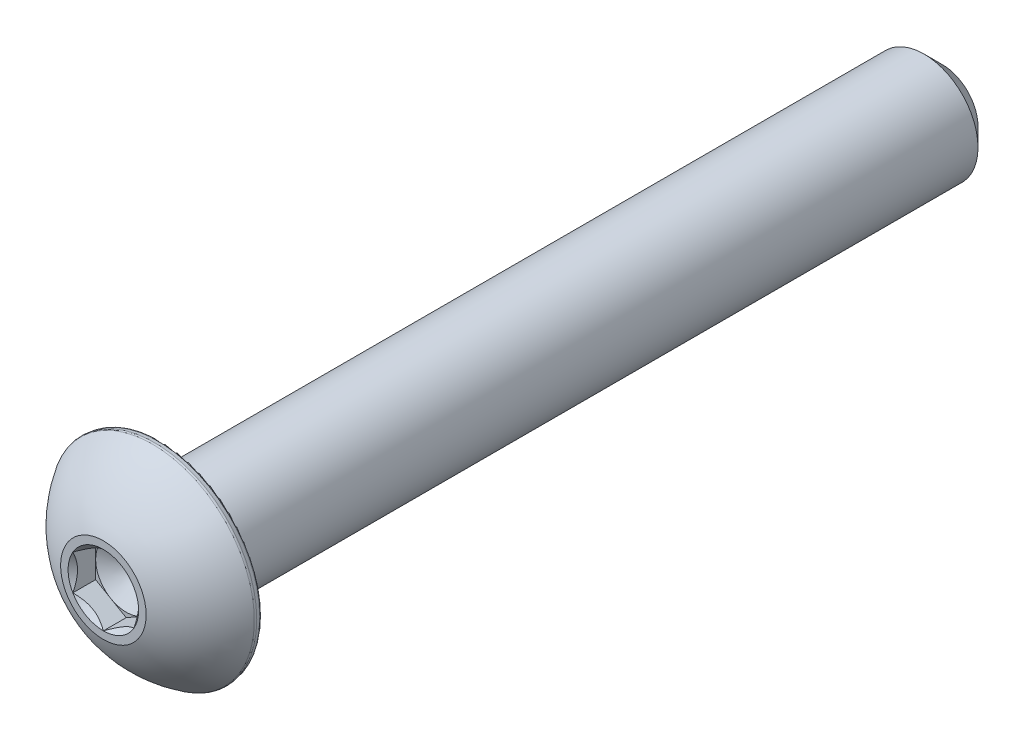
ISO-10303-21;
HEADER;
FILE_DESCRIPTION(('STEP AP214'),'2;1');
FILE_NAME('part.step','',(''),(''),'','','');
FILE_SCHEMA(('AUTOMOTIVE_DESIGN { 1 0 10303 214 1 1 1 1 }'));
ENDSEC;
DATA;
#1=APPLICATION_CONTEXT('core data for automotive mechanical design processes');
#2=APPLICATION_PROTOCOL_DEFINITION('international standard','automotive_design',2000,#1);
#3=PRODUCT_CONTEXT('',#1,'mechanical');
#4=PRODUCT('Part','Part','',(#3));
#5=PRODUCT_RELATED_PRODUCT_CATEGORY('part','',(#4));
#6=PRODUCT_DEFINITION_FORMATION('','',#4);
#7=PRODUCT_DEFINITION_CONTEXT('part definition',#1,'design');
#8=PRODUCT_DEFINITION('design','',#6,#7);
#9=PRODUCT_DEFINITION_SHAPE('','',#8);
#10=(LENGTH_UNIT() NAMED_UNIT(*) SI_UNIT(.MILLI.,.METRE.));
#11=(NAMED_UNIT(*) PLANE_ANGLE_UNIT() SI_UNIT($,.RADIAN.));
#12=(NAMED_UNIT(*) SI_UNIT($,.STERADIAN.) SOLID_ANGLE_UNIT());
#13=UNCERTAINTY_MEASURE_WITH_UNIT(LENGTH_MEASURE(1.E-05),#10,'distance_accuracy_value','');
#14=(GEOMETRIC_REPRESENTATION_CONTEXT(3) GLOBAL_UNCERTAINTY_ASSIGNED_CONTEXT((#13)) GLOBAL_UNIT_ASSIGNED_CONTEXT((#10,
#11,#12)) REPRESENTATION_CONTEXT('',''));
#15=CARTESIAN_POINT('',(0.,0.,0.));
#16=DIRECTION('',(0.,0.,1.));
#17=DIRECTION('',(1.,0.,0.));
#18=AXIS2_PLACEMENT_3D('',#15,#16,#17);
#19=CARTESIAN_POINT('',(0.,0.9921875,13.6271));
#20=DIRECTION('',(0.,0.,-1.));
#21=DIRECTION('',(-1.,0.,0.));
#22=AXIS2_PLACEMENT_3D('',#19,#20,#21);
#23=PLANE('',#22);
#24=CARTESIAN_POINT('',(0.,0.,13.6271));
#25=DIRECTION('',(0.,0.,1.));
#26=DIRECTION('',(1.,0.,0.));
#27=AXIS2_PLACEMENT_3D('',#24,#25,#26);
#28=CIRCLE('',#27,1.3890625);
#29=CARTESIAN_POINT('',(1.3890625,0.,13.6271));
#30=VERTEX_POINT('',#29);
#31=EDGE_CURVE('E175',#30,#30,#28,.T.);
#32=ORIENTED_EDGE('',*,*,#31,.T.);
#33=EDGE_LOOP('',(#32));
#34=FACE_BOUND('',#33,.T.);
#35=CARTESIAN_POINT('',(0.,0.,13.6271));
#36=DIRECTION('',(0.,0.,1.));
#37=DIRECTION('',(1.,0.,0.));
#38=AXIS2_PLACEMENT_3D('',#35,#36,#37);
#39=CIRCLE('',#38,1.14567944042316);
#40=CARTESIAN_POINT('',(0.,1.14567944042316,13.6271));
#41=VERTEX_POINT('',#40);
#42=CARTESIAN_POINT('',(-0.992187500000001,0.57283972021158,13.6271));
#43=VERTEX_POINT('',#42);
#44=EDGE_CURVE('E129',#41,#43,#39,.T.);
#45=ORIENTED_EDGE('',*,*,#44,.F.);
#46=CARTESIAN_POINT('',(0.,0.,13.6271));
#47=DIRECTION('',(0.,0.,1.));
#48=DIRECTION('',(1.,0.,0.));
#49=AXIS2_PLACEMENT_3D('',#46,#47,#48);
#50=CIRCLE('',#49,1.14567944042316);
#51=CARTESIAN_POINT('',(0.9921875,0.572839720211582,13.6271));
#52=VERTEX_POINT('',#51);
#53=EDGE_CURVE('E114',#52,#41,#50,.T.);
#54=ORIENTED_EDGE('',*,*,#53,.F.);
#55=CARTESIAN_POINT('',(0.,0.,13.6271));
#56=DIRECTION('',(0.,0.,1.));
#57=DIRECTION('',(1.,0.,0.));
#58=AXIS2_PLACEMENT_3D('',#55,#56,#57);
#59=CIRCLE('',#58,1.14567944042316);
#60=CARTESIAN_POINT('',(0.9921875,-0.572839720211582,13.6271));
#61=VERTEX_POINT('',#60);
#62=EDGE_CURVE('E125',#61,#52,#59,.T.);
#63=ORIENTED_EDGE('',*,*,#62,.F.);
#64=CARTESIAN_POINT('',(0.,0.,13.6271));
#65=DIRECTION('',(0.,0.,1.));
#66=DIRECTION('',(1.,0.,0.));
#67=AXIS2_PLACEMENT_3D('',#64,#65,#66);
#68=CIRCLE('',#67,1.14567944042316);
#69=CARTESIAN_POINT('',(0.,-1.14567944042316,13.6271));
#70=VERTEX_POINT('',#69);
#71=EDGE_CURVE('E146',#70,#61,#68,.T.);
#72=ORIENTED_EDGE('',*,*,#71,.F.);
#73=CARTESIAN_POINT('',(0.,0.,13.6271));
#74=DIRECTION('',(0.,0.,1.));
#75=DIRECTION('',(1.,0.,0.));
#76=AXIS2_PLACEMENT_3D('',#73,#74,#75);
#77=CIRCLE('',#76,1.14567944042316);
#78=CARTESIAN_POINT('',(-0.9921875,-0.572839720211582,13.6271));
#79=VERTEX_POINT('',#78);
#80=EDGE_CURVE('E548',#79,#70,#77,.T.);
#81=ORIENTED_EDGE('',*,*,#80,.F.);
#82=CARTESIAN_POINT('',(0.,0.,13.6271));
#83=DIRECTION('',(0.,0.,1.));
#84=DIRECTION('',(1.,0.,0.));
#85=AXIS2_PLACEMENT_3D('',#82,#83,#84);
#86=CIRCLE('',#85,1.14567944042316);
#87=EDGE_CURVE('E292',#43,#79,#86,.T.);
#88=ORIENTED_EDGE('',*,*,#87,.F.);
#89=EDGE_LOOP('',(#45,#54,#63,#72,#81,#88));
#90=FACE_BOUND('',#89,.T.);
#91=ADVANCED_FACE('F41',(#34,#90),#23,.F.);
#92=CARTESIAN_POINT('',(0.,0.,-13.6271));
#93=DIRECTION('',(0.,0.,1.));
#94=DIRECTION('',(1.,0.,0.));
#95=AXIS2_PLACEMENT_3D('',#92,#93,#94);
#96=CONICAL_SURFACE('',#95,1.1572875,0.785398163397447);
#97=CARTESIAN_POINT('',(0.,0.,-13.0317875));
#98=DIRECTION('',(0.,0.,1.));
#99=DIRECTION('',(1.,0.,0.));
#100=AXIS2_PLACEMENT_3D('',#97,#98,#99);
#101=CIRCLE('',#100,1.7526);
#102=CARTESIAN_POINT('',(1.7526,0.,-13.0317875));
#103=VERTEX_POINT('',#102);
#104=EDGE_CURVE('E182',#103,#103,#101,.T.);
#105=ORIENTED_EDGE('',*,*,#104,.F.);
#106=EDGE_LOOP('',(#105));
#107=FACE_BOUND('',#106,.T.);
#108=CARTESIAN_POINT('',(0.,0.,-13.6271));
#109=DIRECTION('',(0.,0.,1.));
#110=DIRECTION('',(1.,0.,0.));
#111=AXIS2_PLACEMENT_3D('',#108,#109,#110);
#112=CIRCLE('',#111,1.1572875);
#113=CARTESIAN_POINT('',(1.1572875,0.,-13.6271));
#114=VERTEX_POINT('',#113);
#115=EDGE_CURVE('E168',#114,#114,#112,.T.);
#116=ORIENTED_EDGE('',*,*,#115,.T.);
#117=EDGE_LOOP('',(#116));
#118=FACE_BOUND('',#117,.T.);
#119=ADVANCED_FACE('F219',(#107,#118),#96,.T.);
#120=CARTESIAN_POINT('',(0.,0.,13.6271));
#121=DIRECTION('',(0.,0.,1.));
#122=DIRECTION('',(1.,0.,0.));
#123=AXIS2_PLACEMENT_3D('',#120,#121,#122);
#124=CYLINDRICAL_SURFACE('',#123,1.7526);
#125=CARTESIAN_POINT('',(0.,0.,11.7729));
#126=DIRECTION('',(0.,0.,1.));
#127=DIRECTION('',(1.,0.,0.));
#128=AXIS2_PLACEMENT_3D('',#125,#126,#127);
#129=CIRCLE('',#128,1.7526);
#130=CARTESIAN_POINT('',(1.7526,0.,11.7729));
#131=VERTEX_POINT('',#130);
#132=EDGE_CURVE('E179',#131,#131,#129,.T.);
#133=ORIENTED_EDGE('',*,*,#132,.F.);
#134=EDGE_LOOP('',(#133));
#135=FACE_BOUND('',#134,.T.);
#136=ORIENTED_EDGE('',*,*,#104,.T.);
#137=EDGE_LOOP('',(#136));
#138=FACE_BOUND('',#137,.T.);
#139=ADVANCED_FACE('F226',(#135,#138),#124,.T.);
#140=CARTESIAN_POINT('',(0.,3.28741155973219,11.7729));
#141=DIRECTION('',(0.,0.,1.));
#142=DIRECTION('',(1.,0.,0.));
#143=AXIS2_PLACEMENT_3D('',#140,#141,#142);
#144=PLANE('',#143);
#145=CARTESIAN_POINT('',(0.,0.,11.7729));
#146=DIRECTION('',(0.,0.,1.));
#147=DIRECTION('',(1.,0.,0.));
#148=AXIS2_PLACEMENT_3D('',#145,#146,#147);
#149=CIRCLE('',#148,3.20961863292574);
#150=CARTESIAN_POINT('',(3.20961863292574,0.,11.7729));
#151=VERTEX_POINT('',#150);
#152=EDGE_CURVE('E49',#151,#151,#149,.F.);
#153=ORIENTED_EDGE('',*,*,#152,.T.);
#154=EDGE_LOOP('',(#153));
#155=FACE_BOUND('',#154,.T.);
#156=ORIENTED_EDGE('',*,*,#132,.T.);
#157=EDGE_LOOP('',(#156));
#158=FACE_BOUND('',#157,.T.);
#159=ADVANCED_FACE('F193',(#155,#158),#144,.F.);
#160=CARTESIAN_POINT('',(0.,0.,11.7729));
#161=DIRECTION('',(0.,0.,1.));
#162=DIRECTION('',(1.,0.,0.));
#163=AXIS2_PLACEMENT_3D('',#160,#161,#162);
#164=CONICAL_SURFACE('',#163,3.28741155973219,0.174532925199426);
#165=CARTESIAN_POINT('',(0.,0.,11.8495110774485));
#166=DIRECTION('',(0.,0.,-1.));
#167=DIRECTION('',(-1.,0.,0.));
#168=AXIS2_PLACEMENT_3D('',#165,#166,#167);
#169=CIRCLE('',#168,3.30092015970751);
#170=CARTESIAN_POINT('',(-3.30092015970751,0.,11.8495110774485));
#171=VERTEX_POINT('',#170);
#172=EDGE_CURVE('E188',#171,#171,#169,.F.);
#173=ORIENTED_EDGE('',*,*,#172,.T.);
#174=EDGE_LOOP('',(#173));
#175=FACE_BOUND('',#174,.T.);
#176=CARTESIAN_POINT('',(0.,0.,11.965362863037));
#177=DIRECTION('',(0.,0.,-1.));
#178=DIRECTION('',(-1.,0.,0.));
#179=AXIS2_PLACEMENT_3D('',#176,#177,#178);
#180=CIRCLE('',#179,3.32134795527);
#181=CARTESIAN_POINT('',(-3.32134795527,0.,11.965362863037));
#182=VERTEX_POINT('',#181);
#183=EDGE_CURVE('E185',#182,#182,#180,.T.);
#184=ORIENTED_EDGE('',*,*,#183,.T.);
#185=EDGE_LOOP('',(#184));
#186=FACE_BOUND('',#185,.T.);
#187=ADVANCED_FACE('F201',(#175,#186),#164,.T.);
#188=CARTESIAN_POINT('',(0.,0.,10.0046132454163));
#189=DIRECTION('',(0.,0.,1.));
#190=DIRECTION('',(0.,1.,0.));
#191=AXIS2_PLACEMENT_3D('',#188,#189,#190);
#192=SPHERICAL_SURFACE('',#191,3.87967845523838);
#193=CARTESIAN_POINT('',(0.,0.,12.029857654296));
#194=DIRECTION('',(0.,0.,-1.));
#195=DIRECTION('',(-1.,0.,0.));
#196=AXIS2_PLACEMENT_3D('',#193,#194,#195);
#197=CIRCLE('',#196,3.30912224016312);
#198=CARTESIAN_POINT('',(-3.30912224016312,0.,12.029857654296));
#199=VERTEX_POINT('',#198);
#200=EDGE_CURVE('E11',#199,#199,#197,.F.);
#201=ORIENTED_EDGE('',*,*,#200,.T.);
#202=EDGE_LOOP('',(#201));
#203=FACE_BOUND('',#202,.T.);
#204=ORIENTED_EDGE('',*,*,#31,.F.);
#205=EDGE_LOOP('',(#204));
#206=FACE_BOUND('',#205,.T.);
#207=ADVANCED_FACE('F204',(#203,#206),#192,.T.);
#208=CARTESIAN_POINT('',(0.,1.1572875,-13.6271));
#209=DIRECTION('',(0.,0.,1.));
#210=DIRECTION('',(1.,0.,0.));
#211=AXIS2_PLACEMENT_3D('',#208,#209,#210);
#212=PLANE('',#211);
#213=ORIENTED_EDGE('',*,*,#115,.F.);
#214=EDGE_LOOP('',(#213));
#215=FACE_BOUND('',#214,.T.);
#216=ADVANCED_FACE('F214',(#215),#212,.F.);
#217=CARTESIAN_POINT('',(0.9921875,0.572839720211583,13.6271));
#218=DIRECTION('',(-0.5,-0.866025403784439,0.));
#219=DIRECTION('',(0.866025403784439,-0.5,0.));
#220=AXIS2_PLACEMENT_3D('',#217,#218,#219);
#221=PLANE('',#220);
#222=CARTESIAN_POINT('',(0.9923875,0.572724250157745,13.627215487509));
#223=CARTESIAN_POINT('',(0.958273424767844,0.592420020676185,13.6075328114047));
#224=CARTESIAN_POINT('',(0.923588910507721,0.612445134320979,13.5890056845184));
#225=CARTESIAN_POINT('',(0.852862918800041,0.65327880467211,13.5550823296504));
#226=CARTESIAN_POINT('',(0.816814708375758,0.674091248664374,13.5397049872309));
#227=CARTESIAN_POINT('',(0.744124988262605,0.716058678139022,13.5133631427343));
#228=CARTESIAN_POINT('',(0.707502010986799,0.737202963927734,13.5023323965131));
#229=CARTESIAN_POINT('',(0.633449993753944,0.779956916011157,13.4853362056729));
#230=CARTESIAN_POINT('',(0.596023217440658,0.801565275390533,13.4793580675789));
#231=CARTESIAN_POINT('',(0.53152286139453,0.838804573316592,13.4739663449143));
#232=CARTESIAN_POINT('',(0.504533200685471,0.854387061192303,13.4731689963883));
#233=CARTESIAN_POINT('',(0.450606144054337,0.885521861854893,13.4745081933614));
#234=CARTESIAN_POINT('',(0.423668760975761,0.901074167226573,13.476645386137));
#235=CARTESIAN_POINT('',(0.343241277041503,0.947508996726261,13.487317571306));
#236=CARTESIAN_POINT('',(0.290151430636718,0.9781604338393,13.5001143807227));
#237=CARTESIAN_POINT('',(0.196972862034203,1.03195710550467,13.5309974676501));
#238=CARTESIAN_POINT('',(0.156447193690484,1.055354611032,13.5474650089077));
#239=CARTESIAN_POINT('',(0.0769831842917925,1.10123317824922,13.5845603835568));
#240=CARTESIAN_POINT('',(0.0380401617384759,1.12371694280344,13.6051746806455));
#241=CARTESIAN_POINT('',(-0.000200000000000987,1.145794910477,13.627215487509));
#242=B_SPLINE_CURVE_WITH_KNOTS('',3,(#222,#223,#224,#225,#226,#227,#228,#229,#230,#231,#232,
#233,#234,#235,#236,#237,#238,#239,#240,#241),.UNSPECIFIED.,.F.,.F.,(4,2,2,2,2,2,2,2,2,4),(0.,
0.13219718521019,0.265165186853262,0.396020097605669,0.526545281028573,0.619935205043264,
0.713345731536163,0.900220051846368,1.04884529769095,1.1969930355767),.UNSPECIFIED.);
#243=EDGE_CURVE('E111',#52,#41,#242,.T.);
#244=ORIENTED_EDGE('',*,*,#243,.T.);
#245=DIRECTION('',(0.,0.,-1.));
#246=VECTOR('',#245,1.);
#247=CARTESIAN_POINT('',(0.,1.14567944042316,13.6271));
#248=LINE('',#247,#246);
#249=CARTESIAN_POINT('',(0.,1.14567944042316,12.88542));
#250=VERTEX_POINT('',#249);
#251=EDGE_CURVE('E166',#41,#250,#248,.T.);
#252=ORIENTED_EDGE('',*,*,#251,.T.);
#253=DIRECTION('',(-0.866025403784439,0.5,0.));
#254=VECTOR('',#253,1.);
#255=CARTESIAN_POINT('',(0.9921875,0.572839720211583,12.88542));
#256=LINE('',#255,#254);
#257=CARTESIAN_POINT('',(0.496093749999999,0.859259580317373,12.88542));
#258=VERTEX_POINT('',#257);
#259=EDGE_CURVE('E295',#258,#250,#256,.T.);
#260=ORIENTED_EDGE('',*,*,#259,.F.);
#261=CARTESIAN_POINT('',(0.9921875,0.572839720211583,12.88542));
#262=VERTEX_POINT('',#261);
#263=EDGE_CURVE('E56',#262,#258,#256,.T.);
#264=ORIENTED_EDGE('',*,*,#263,.F.);
#265=DIRECTION('',(0.,0.,-1.));
#266=VECTOR('',#265,1.);
#267=CARTESIAN_POINT('',(0.9921875,0.572839720211583,13.6271));
#268=LINE('',#267,#266);
#269=EDGE_CURVE('E142',#52,#262,#268,.T.);
#270=ORIENTED_EDGE('',*,*,#269,.F.);
#271=EDGE_LOOP('',(#244,#252,#260,#264,#270));
#272=FACE_BOUND('',#271,.T.);
#273=ADVANCED_FACE('F148',(#272),#221,.T.);
#274=CARTESIAN_POINT('',(0.,1.14567944042316,13.6271));
#275=DIRECTION('',(0.500000000000001,-0.866025403784438,0.));
#276=DIRECTION('',(0.866025403784438,0.500000000000001,0.));
#277=AXIS2_PLACEMENT_3D('',#274,#275,#276);
#278=PLANE('',#277);
#279=CARTESIAN_POINT('',(0.000199999999999419,1.145794910477,13.627215487509));
#280=CARTESIAN_POINT('',(-0.0339140752321569,1.12609913995856,13.6075328114047));
#281=CARTESIAN_POINT('',(-0.0685985894922812,1.10607402631377,13.5890056845184));
#282=CARTESIAN_POINT('',(-0.139324581199961,1.06524035596263,13.5550823296504));
#283=CARTESIAN_POINT('',(-0.175372791624244,1.04442791197037,13.5397049872309));
#284=CARTESIAN_POINT('',(-0.248062511737398,1.00246048249572,13.5133631427343));
#285=CARTESIAN_POINT('',(-0.284685489013203,0.981316196707011,13.5023323965131));
#286=CARTESIAN_POINT('',(-0.358737506246059,0.938562244623587,13.4853362056729));
#287=CARTESIAN_POINT('',(-0.396164282559345,0.916953885244211,13.4793580675789));
#288=CARTESIAN_POINT('',(-0.460664638605473,0.879714587318152,13.4739663449143));
#289=CARTESIAN_POINT('',(-0.487654299314532,0.864132099442441,13.4731689963883));
#290=CARTESIAN_POINT('',(-0.541581355945667,0.832997298779851,13.4745081933614));
#291=CARTESIAN_POINT('',(-0.568518739024242,0.817444993408171,13.476645386137));
#292=CARTESIAN_POINT('',(-0.6489462229585,0.771010163908483,13.487317571306));
#293=CARTESIAN_POINT('',(-0.702036069363285,0.740358726795444,13.5001143807227));
#294=CARTESIAN_POINT('',(-0.7952146379658,0.686562055130078,13.5309974676501));
#295=CARTESIAN_POINT('',(-0.835740306309519,0.663164549602743,13.5474650089077));
#296=CARTESIAN_POINT('',(-0.915204315708209,0.617285982385521,13.5845603835568));
#297=CARTESIAN_POINT('',(-0.954147338261525,0.594802217831307,13.6051746806455));
#298=CARTESIAN_POINT('',(-0.992387500000001,0.572724250157743,13.627215487509));
#299=B_SPLINE_CURVE_WITH_KNOTS('',3,(#279,#280,#281,#282,#283,#284,#285,#286,#287,#288,#289,
#290,#291,#292,#293,#294,#295,#296,#297,#298),.UNSPECIFIED.,.F.,.F.,(4,2,2,2,2,2,2,2,2,4),(0.,
0.132197185210193,0.265165186853265,0.396020097605672,0.526545281028576,0.619935205043267,
0.713345731536167,0.900220051846372,1.04884529769095,1.1969930355767),.UNSPECIFIED.);
#300=EDGE_CURVE('E283',#41,#43,#299,.T.);
#301=ORIENTED_EDGE('',*,*,#300,.T.);
#302=DIRECTION('',(0.,0.,-1.));
#303=VECTOR('',#302,1.);
#304=CARTESIAN_POINT('',(-0.992187500000001,0.572839720211581,13.6271));
#305=LINE('',#304,#303);
#306=CARTESIAN_POINT('',(-0.992187500000001,0.572839720211581,12.88542));
#307=VERTEX_POINT('',#306);
#308=EDGE_CURVE('E163',#43,#307,#305,.T.);
#309=ORIENTED_EDGE('',*,*,#308,.T.);
#310=DIRECTION('',(-0.866025403784438,-0.500000000000001,0.));
#311=VECTOR('',#310,1.);
#312=CARTESIAN_POINT('',(0.,1.14567944042316,12.88542));
#313=LINE('',#312,#311);
#314=CARTESIAN_POINT('',(-0.496093750000001,0.859259580317373,12.88542));
#315=VERTEX_POINT('',#314);
#316=EDGE_CURVE('E297',#315,#307,#313,.T.);
#317=ORIENTED_EDGE('',*,*,#316,.F.);
#318=EDGE_CURVE('E298',#250,#315,#313,.T.);
#319=ORIENTED_EDGE('',*,*,#318,.F.);
#320=ORIENTED_EDGE('',*,*,#251,.F.);
#321=EDGE_LOOP('',(#301,#309,#317,#319,#320));
#322=FACE_BOUND('',#321,.T.);
#323=ADVANCED_FACE('F249',(#322),#278,.T.);
#324=CARTESIAN_POINT('',(-0.992187500000001,0.572839720211581,13.6271));
#325=DIRECTION('',(1.,0.,0.));
#326=DIRECTION('',(0.,1.,0.));
#327=AXIS2_PLACEMENT_3D('',#324,#325,#326);
#328=PLANE('',#327);
#329=CARTESIAN_POINT('',(-0.9921875,-1.10949418891906,13.9698470409327));
#330=CARTESIAN_POINT('',(-0.9921875,-1.0823248648886,13.9495977650143));
#331=CARTESIAN_POINT('',(-0.9921875,-1.0550006408226,13.9295568710457));
#332=CARTESIAN_POINT('',(-0.9921875,-0.999980792873914,13.8899768868049));
#333=CARTESIAN_POINT('',(-0.9921875,-0.972285074627779,13.8704379278497));
#334=CARTESIAN_POINT('',(-0.9921875,-0.888143426458247,13.8124234554565));
#335=CARTESIAN_POINT('',(-0.9921875,-0.831056182145668,13.7748623928985));
#336=CARTESIAN_POINT('',(-0.9921875,-0.711554440354375,13.7014195358545));
#337=CARTESIAN_POINT('',(-0.9921875,-0.649018130618403,13.6657335899983));
#338=CARTESIAN_POINT('',(-0.9921875,-0.520865585622979,13.6006639049752));
#339=CARTESIAN_POINT('',(-0.9921875,-0.455260644614128,13.5712589787957));
#340=CARTESIAN_POINT('',(-0.9921875,-0.35646448736768,13.5352954983595));
#341=CARTESIAN_POINT('',(-0.9921875,-0.324666846387041,13.5249208050058));
#342=CARTESIAN_POINT('',(-0.9921875,-0.26033277698824,13.5067288358135));
#343=CARTESIAN_POINT('',(-0.9921875,-0.227796295081892,13.4989117457672));
#344=CARTESIAN_POINT('',(-0.9921875,-0.162712405358303,13.4863637547531));
#345=CARTESIAN_POINT('',(-0.9921875,-0.130175055255582,13.4815814793169));
#346=CARTESIAN_POINT('',(-0.9921875,-0.0647778707960089,13.4751881200598));
#347=CARTESIAN_POINT('',(-0.992187500000001,-0.0319179811139638,13.4735775901906));
#348=CARTESIAN_POINT('',(-0.992187500000001,0.0327400524007124,13.4736384241559));
#349=CARTESIAN_POINT('',(-0.992187500000001,0.0645383411726862,13.4752058628384));
#350=CARTESIAN_POINT('',(-0.992187500000001,0.127849181023788,13.4813145432134));
#351=CARTESIAN_POINT('',(-0.992187500000001,0.159361674088216,13.4858563755709));
#352=CARTESIAN_POINT('',(-0.992187500000001,0.222401055147185,13.4977486114099));
#353=CARTESIAN_POINT('',(-0.992187500000001,0.25391903049348,13.5051455740016));
#354=CARTESIAN_POINT('',(-0.992187500000001,0.316270119305014,13.5223649633627));
#355=CARTESIAN_POINT('',(-0.992187500000001,0.347103300686062,13.5321871484245));
#356=CARTESIAN_POINT('',(-0.992187500000001,0.445747348418668,13.567264086148));
#357=CARTESIAN_POINT('',(-0.992187500000001,0.512111869884733,13.5965775702976));
#358=CARTESIAN_POINT('',(-0.992187500000001,0.641707751633624,13.6617033241341));
#359=CARTESIAN_POINT('',(-0.992187500000001,0.704926593628331,13.697539267595));
#360=CARTESIAN_POINT('',(-0.992187500000001,0.825720927781168,13.7714181448275));
#361=CARTESIAN_POINT('',(-0.992187500000001,0.883420488382574,13.8092606988511));
#362=CARTESIAN_POINT('',(-0.992187500000001,0.968430125783475,13.8677387372263));
#363=CARTESIAN_POINT('',(-0.992187500000001,0.996398939377162,13.8874332531538));
#364=CARTESIAN_POINT('',(-0.992187500000001,1.05195567836533,13.9273371742085));
#365=CARTESIAN_POINT('',(-0.992187500000001,1.07954370555033,13.9475464374577));
#366=CARTESIAN_POINT('',(-0.992187500000001,1.10697339818653,13.9679689575272));
#367=B_SPLINE_CURVE_WITH_KNOTS('',3,(#329,#330,#331,#332,#333,#334,#335,#336,#337,#338,#339,
#340,#341,#342,#343,#344,#345,#346,#347,#348,#349,#350,#351,#352,#353,#354,#355,#356,#357,#358,
#359,#360,#361,#362,#363,#364,#365,#366),.UNSPECIFIED.,.F.,.F.,(4,2,2,2,2,2,2,2,2,2,2,2,2,2,2,2,
2,2,4),(0.,0.10165285617456,0.2033320415304,0.408242719174564,0.624062035020539,
0.839141436739499,0.939397795991985,1.0396614365623,1.1381790118448,1.23671379188978,
1.332078293144,1.42746173794517,1.52447122946096,1.62147105651117,1.83847882513562,
2.0562905439946,2.26319512011788,2.36581270183829,2.46840229912001),.UNSPECIFIED.);
#368=EDGE_CURVE('E291',#43,#79,#367,.F.);
#369=ORIENTED_EDGE('',*,*,#368,.T.);
#370=DIRECTION('',(0.,0.,-1.));
#371=VECTOR('',#370,1.);
#372=CARTESIAN_POINT('',(-0.9921875,-0.572839720211582,13.6271));
#373=LINE('',#372,#371);
#374=CARTESIAN_POINT('',(-0.9921875,-0.572839720211582,12.88542));
#375=VERTEX_POINT('',#374);
#376=EDGE_CURVE('E160',#79,#375,#373,.T.);
#377=ORIENTED_EDGE('',*,*,#376,.T.);
#378=DIRECTION('',(0.,-1.,0.));
#379=VECTOR('',#378,1.);
#380=CARTESIAN_POINT('',(-0.992187500000001,0.572839720211581,12.88542));
#381=LINE('',#380,#379);
#382=CARTESIAN_POINT('',(-0.992187500000001,0.,12.88542));
#383=VERTEX_POINT('',#382);
#384=EDGE_CURVE('E301',#383,#375,#381,.T.);
#385=ORIENTED_EDGE('',*,*,#384,.F.);
#386=EDGE_CURVE('E302',#307,#383,#381,.T.);
#387=ORIENTED_EDGE('',*,*,#386,.F.);
#388=ORIENTED_EDGE('',*,*,#308,.F.);
#389=EDGE_LOOP('',(#369,#377,#385,#387,#388));
#390=FACE_BOUND('',#389,.T.);
#391=ADVANCED_FACE('F254',(#390),#328,.T.);
#392=CARTESIAN_POINT('',(-0.9921875,-0.572839720211582,13.6271));
#393=DIRECTION('',(0.499999999999999,0.866025403784439,0.));
#394=DIRECTION('',(-0.866025403784439,0.499999999999999,0.));
#395=AXIS2_PLACEMENT_3D('',#392,#393,#394);
#396=PLANE('',#395);
#397=CARTESIAN_POINT('',(-0.9923875,-0.572724250157744,13.627215487509));
#398=CARTESIAN_POINT('',(-0.958273424767844,-0.592420020676184,13.6075328114047));
#399=CARTESIAN_POINT('',(-0.92358891050772,-0.612445134320978,13.5890056845184));
#400=CARTESIAN_POINT('',(-0.85286291880004,-0.653278804672111,13.5550823296504));
#401=CARTESIAN_POINT('',(-0.816814708375757,-0.674091248664375,13.5397049872309));
#402=CARTESIAN_POINT('',(-0.744124988262603,-0.716058678139022,13.5133631427343));
#403=CARTESIAN_POINT('',(-0.707502010986798,-0.737202963927734,13.5023323965131));
#404=CARTESIAN_POINT('',(-0.633449993753942,-0.779956916011158,13.4853362056729));
#405=CARTESIAN_POINT('',(-0.596023217440656,-0.801565275390534,13.4793580675789));
#406=CARTESIAN_POINT('',(-0.531522861394528,-0.838804573316593,13.4739663449143));
#407=CARTESIAN_POINT('',(-0.504533200685469,-0.854387061192304,13.4731689963883));
#408=CARTESIAN_POINT('',(-0.450606144054334,-0.885521861854894,13.4745081933614));
#409=CARTESIAN_POINT('',(-0.423668760975759,-0.901074167226574,13.476645386137));
#410=CARTESIAN_POINT('',(-0.343241277041501,-0.947508996726261,13.487317571306));
#411=CARTESIAN_POINT('',(-0.290151430636716,-0.9781604338393,13.5001143807227));
#412=CARTESIAN_POINT('',(-0.196972862034201,-1.03195710550467,13.5309974676501));
#413=CARTESIAN_POINT('',(-0.156447193690483,-1.055354611032,13.5474650089077));
#414=CARTESIAN_POINT('',(-0.0769831842917922,-1.10123317824922,13.5845603835568));
#415=CARTESIAN_POINT('',(-0.0380401617384761,-1.12371694280344,13.6051746806455));
#416=CARTESIAN_POINT('',(0.000200000000000467,-1.145794910477,13.627215487509));
#417=B_SPLINE_CURVE_WITH_KNOTS('',3,(#397,#398,#399,#400,#401,#402,#403,#404,#405,#406,#407,
#408,#409,#410,#411,#412,#413,#414,#415,#416),.UNSPECIFIED.,.F.,.F.,(4,2,2,2,2,2,2,2,2,4),(0.,
0.132197185210192,0.265165186853264,0.396020097605671,0.526545281028576,0.619935205043267,
0.713345731536167,0.900220051846371,1.04884529769095,1.1969930355767),.UNSPECIFIED.);
#418=EDGE_CURVE('E550',#79,#70,#417,.T.);
#419=ORIENTED_EDGE('',*,*,#418,.T.);
#420=DIRECTION('',(0.,0.,-1.));
#421=VECTOR('',#420,1.);
#422=CARTESIAN_POINT('',(0.,-1.14567944042316,13.6271));
#423=LINE('',#422,#421);
#424=CARTESIAN_POINT('',(0.,-1.14567944042316,12.88542));
#425=VERTEX_POINT('',#424);
#426=EDGE_CURVE('E151',#70,#425,#423,.T.);
#427=ORIENTED_EDGE('',*,*,#426,.T.);
#428=DIRECTION('',(0.866025403784439,-0.499999999999999,0.));
#429=VECTOR('',#428,1.);
#430=CARTESIAN_POINT('',(-0.9921875,-0.572839720211582,12.88542));
#431=LINE('',#430,#429);
#432=CARTESIAN_POINT('',(-0.496093749999999,-0.859259580317373,12.88542));
#433=VERTEX_POINT('',#432);
#434=EDGE_CURVE('E305',#433,#425,#431,.T.);
#435=ORIENTED_EDGE('',*,*,#434,.F.);
#436=EDGE_CURVE('E306',#375,#433,#431,.T.);
#437=ORIENTED_EDGE('',*,*,#436,.F.);
#438=ORIENTED_EDGE('',*,*,#376,.F.);
#439=EDGE_LOOP('',(#419,#427,#435,#437,#438));
#440=FACE_BOUND('',#439,.T.);
#441=ADVANCED_FACE('F258',(#440),#396,.T.);
#442=CARTESIAN_POINT('',(0.,-1.14567944042316,13.6271));
#443=DIRECTION('',(-0.5,0.866025403784438,0.));
#444=DIRECTION('',(-0.866025403784438,-0.5,0.));
#445=AXIS2_PLACEMENT_3D('',#442,#443,#444);
#446=PLANE('',#445);
#447=CARTESIAN_POINT('',(-0.000199999999998939,-1.145794910477,13.627215487509));
#448=CARTESIAN_POINT('',(0.0339140752321572,-1.12609913995856,13.6075328114047));
#449=CARTESIAN_POINT('',(0.0685985894922809,-1.10607402631377,13.5890056845184));
#450=CARTESIAN_POINT('',(0.13932458119996,-1.06524035596263,13.5550823296504));
#451=CARTESIAN_POINT('',(0.175372791624243,-1.04442791197037,13.5397049872309));
#452=CARTESIAN_POINT('',(0.248062511737397,-1.00246048249572,13.5133631427343));
#453=CARTESIAN_POINT('',(0.284685489013202,-0.981316196707011,13.5023323965131));
#454=CARTESIAN_POINT('',(0.358737506246057,-0.938562244623587,13.4853362056729));
#455=CARTESIAN_POINT('',(0.396164282559343,-0.916953885244212,13.4793580675789));
#456=CARTESIAN_POINT('',(0.460664638605471,-0.879714587318153,13.4739663449143));
#457=CARTESIAN_POINT('',(0.487654299314529,-0.864132099442441,13.4731689963883));
#458=CARTESIAN_POINT('',(0.541581355945664,-0.832997298779852,13.4745081933614));
#459=CARTESIAN_POINT('',(0.56851873902424,-0.817444993408172,13.476645386137));
#460=CARTESIAN_POINT('',(0.648946222958497,-0.771010163908484,13.487317571306));
#461=CARTESIAN_POINT('',(0.702036069363282,-0.740358726795445,13.5001143807227));
#462=CARTESIAN_POINT('',(0.795214637965797,-0.686562055130079,13.5309974676501));
#463=CARTESIAN_POINT('',(0.835740306309516,-0.663164549602744,13.5474650089077));
#464=CARTESIAN_POINT('',(0.915204315708207,-0.617285982385523,13.5845603835568));
#465=CARTESIAN_POINT('',(0.954147338261523,-0.594802217831308,13.6051746806455));
#466=CARTESIAN_POINT('',(0.992387499999999,-0.572724250157744,13.627215487509));
#467=B_SPLINE_CURVE_WITH_KNOTS('',3,(#447,#448,#449,#450,#451,#452,#453,#454,#455,#456,#457,
#458,#459,#460,#461,#462,#463,#464,#465,#466),.UNSPECIFIED.,.F.,.F.,(4,2,2,2,2,2,2,2,2,4),(0.,
0.132197185210191,0.265165186853263,0.396020097605669,0.526545281028573,0.619935205043263,
0.713345731536163,0.900220051846368,1.04884529769095,1.19699303557669),.UNSPECIFIED.);
#468=EDGE_CURVE('E318',#70,#61,#467,.T.);
#469=ORIENTED_EDGE('',*,*,#468,.T.);
#470=DIRECTION('',(0.,0.,-1.));
#471=VECTOR('',#470,1.);
#472=CARTESIAN_POINT('',(0.9921875,-0.572839720211581,13.6271));
#473=LINE('',#472,#471);
#474=CARTESIAN_POINT('',(0.9921875,-0.572839720211581,12.88542));
#475=VERTEX_POINT('',#474);
#476=EDGE_CURVE('E145',#61,#475,#473,.T.);
#477=ORIENTED_EDGE('',*,*,#476,.T.);
#478=DIRECTION('',(0.866025403784438,0.5,0.));
#479=VECTOR('',#478,1.);
#480=CARTESIAN_POINT('',(0.,-1.14567944042316,12.88542));
#481=LINE('',#480,#479);
#482=CARTESIAN_POINT('',(0.49609375,-0.859259580317372,12.88542));
#483=VERTEX_POINT('',#482);
#484=EDGE_CURVE('E308',#483,#475,#481,.T.);
#485=ORIENTED_EDGE('',*,*,#484,.F.);
#486=EDGE_CURVE('E309',#425,#483,#481,.T.);
#487=ORIENTED_EDGE('',*,*,#486,.F.);
#488=ORIENTED_EDGE('',*,*,#426,.F.);
#489=EDGE_LOOP('',(#469,#477,#485,#487,#488));
#490=FACE_BOUND('',#489,.T.);
#491=ADVANCED_FACE('F262',(#490),#446,.T.);
#492=CARTESIAN_POINT('',(0.9921875,-0.572839720211581,13.6271));
#493=DIRECTION('',(-1.,0.,0.));
#494=DIRECTION('',(0.,-1.,0.));
#495=AXIS2_PLACEMENT_3D('',#492,#493,#494);
#496=PLANE('',#495);
#497=CARTESIAN_POINT('',(0.9921875,-1.10949418891906,13.9698470409327));
#498=CARTESIAN_POINT('',(0.9921875,-1.08232486488861,13.9495977650143));
#499=CARTESIAN_POINT('',(0.9921875,-1.0550006408226,13.9295568710457));
#500=CARTESIAN_POINT('',(0.9921875,-0.999980792873915,13.8899768868049));
#501=CARTESIAN_POINT('',(0.9921875,-0.972285074627781,13.8704379278497));
#502=CARTESIAN_POINT('',(0.9921875,-0.888143426458248,13.8124234554565));
#503=CARTESIAN_POINT('',(0.9921875,-0.831056182145669,13.7748623928985));
#504=CARTESIAN_POINT('',(0.9921875,-0.711554440354376,13.7014195358545));
#505=CARTESIAN_POINT('',(0.9921875,-0.649018130618404,13.6657335899983));
#506=CARTESIAN_POINT('',(0.9921875,-0.520865585622981,13.6006639049752));
#507=CARTESIAN_POINT('',(0.9921875,-0.45526064461413,13.5712589787957));
#508=CARTESIAN_POINT('',(0.9921875,-0.356464487367681,13.5352954983595));
#509=CARTESIAN_POINT('',(0.9921875,-0.324666846387042,13.5249208050058));
#510=CARTESIAN_POINT('',(0.9921875,-0.260332776988242,13.5067288358135));
#511=CARTESIAN_POINT('',(0.9921875,-0.227796295081893,13.4989117457672));
#512=CARTESIAN_POINT('',(0.9921875,-0.162712405358304,13.4863637547531));
#513=CARTESIAN_POINT('',(0.9921875,-0.130175055255583,13.4815814793169));
#514=CARTESIAN_POINT('',(0.9921875,-0.06477787079601,13.4751881200598));
#515=CARTESIAN_POINT('',(0.9921875,-0.0319179811139649,13.4735775901906));
#516=CARTESIAN_POINT('',(0.9921875,0.0327400524007114,13.4736384241559));
#517=CARTESIAN_POINT('',(0.9921875,0.0645383411726853,13.4752058628384));
#518=CARTESIAN_POINT('',(0.9921875,0.127849181023787,13.4813145432134));
#519=CARTESIAN_POINT('',(0.9921875,0.159361674088216,13.4858563755709));
#520=CARTESIAN_POINT('',(0.9921875,0.222401055147184,13.4977486114099));
#521=CARTESIAN_POINT('',(0.9921875,0.253919030493479,13.5051455740016));
#522=CARTESIAN_POINT('',(0.9921875,0.316270119305013,13.5223649633627));
#523=CARTESIAN_POINT('',(0.9921875,0.347103300686061,13.5321871484245));
#524=CARTESIAN_POINT('',(0.9921875,0.445747348418669,13.567264086148));
#525=CARTESIAN_POINT('',(0.9921875,0.512111869884733,13.5965775702976));
#526=CARTESIAN_POINT('',(0.9921875,0.641707751633623,13.6617033241341));
#527=CARTESIAN_POINT('',(0.9921875,0.704926593628331,13.697539267595));
#528=CARTESIAN_POINT('',(0.9921875,0.825720927781167,13.7714181448275));
#529=CARTESIAN_POINT('',(0.9921875,0.883420488382573,13.8092606988511));
#530=CARTESIAN_POINT('',(0.9921875,0.968430125783475,13.8677387372263));
#531=CARTESIAN_POINT('',(0.9921875,0.996398939377163,13.8874332531538));
#532=CARTESIAN_POINT('',(0.9921875,1.05195567836533,13.9273371742085));
#533=CARTESIAN_POINT('',(0.9921875,1.07954370555034,13.9475464374577));
#534=CARTESIAN_POINT('',(0.9921875,1.10697339818653,13.9679689575272));
#535=B_SPLINE_CURVE_WITH_KNOTS('',3,(#497,#498,#499,#500,#501,#502,#503,#504,#505,#506,#507,
#508,#509,#510,#511,#512,#513,#514,#515,#516,#517,#518,#519,#520,#521,#522,#523,#524,#525,#526,
#527,#528,#529,#530,#531,#532,#533,#534),.UNSPECIFIED.,.F.,.F.,(4,2,2,2,2,2,2,2,2,2,2,2,2,2,2,2,
2,2,4),(0.,0.101652856174561,0.203332041530402,0.408242719174564,0.62406203502054,
0.8391414367395,0.939397795991986,1.0396614365623,1.1381790118448,1.23671379188978,
1.332078293144,1.42746173794517,1.52447122946096,1.62147105651117,1.83847882513562,
2.05629054399461,2.26319512011788,2.36581270183829,2.46840229912002),.UNSPECIFIED.);
#536=EDGE_CURVE('E135',#61,#52,#535,.T.);
#537=ORIENTED_EDGE('',*,*,#536,.T.);
#538=ORIENTED_EDGE('',*,*,#269,.T.);
#539=DIRECTION('',(0.,1.,0.));
#540=VECTOR('',#539,1.);
#541=CARTESIAN_POINT('',(0.9921875,-0.572839720211581,12.88542));
#542=LINE('',#541,#540);
#543=CARTESIAN_POINT('',(0.9921875,0.,12.88542));
#544=VERTEX_POINT('',#543);
#545=EDGE_CURVE('E154',#544,#262,#542,.T.);
#546=ORIENTED_EDGE('',*,*,#545,.F.);
#547=EDGE_CURVE('E149',#475,#544,#542,.T.);
#548=ORIENTED_EDGE('',*,*,#547,.F.);
#549=ORIENTED_EDGE('',*,*,#476,.F.);
#550=EDGE_LOOP('',(#537,#538,#546,#548,#549));
#551=FACE_BOUND('',#550,.T.);
#552=ADVANCED_FACE('F140',(#551),#496,.T.);
#553=CARTESIAN_POINT('',(0.,0.,12.88542));
#554=DIRECTION('',(0.,0.,1.));
#555=DIRECTION('',(1.,0.,0.));
#556=AXIS2_PLACEMENT_3D('',#553,#554,#555);
#557=PLANE('',#556);
#558=CARTESIAN_POINT('',(0.,0.,12.88542));
#559=DIRECTION('',(0.,0.,1.));
#560=DIRECTION('',(1.,0.,0.));
#561=AXIS2_PLACEMENT_3D('',#558,#559,#560);
#562=CIRCLE('',#561,0.9921875);
#563=EDGE_CURVE('E171',#483,#544,#562,.T.);
#564=ORIENTED_EDGE('',*,*,#563,.F.);
#565=ORIENTED_EDGE('',*,*,#484,.T.);
#566=ORIENTED_EDGE('',*,*,#547,.T.);
#567=EDGE_LOOP('',(#564,#565,#566));
#568=FACE_BOUND('',#567,.T.);
#569=ADVANCED_FACE('F269',(#568),#557,.T.);
#570=EDGE_CURVE('E324',#433,#483,#562,.T.);
#571=ORIENTED_EDGE('',*,*,#570,.F.);
#572=ORIENTED_EDGE('',*,*,#434,.T.);
#573=ORIENTED_EDGE('',*,*,#486,.T.);
#574=EDGE_LOOP('',(#571,#572,#573));
#575=FACE_BOUND('',#574,.T.);
#576=ADVANCED_FACE('F271',(#575),#557,.T.);
#577=EDGE_CURVE('E325',#383,#433,#562,.T.);
#578=ORIENTED_EDGE('',*,*,#577,.F.);
#579=ORIENTED_EDGE('',*,*,#384,.T.);
#580=ORIENTED_EDGE('',*,*,#436,.T.);
#581=EDGE_LOOP('',(#578,#579,#580));
#582=FACE_BOUND('',#581,.T.);
#583=ADVANCED_FACE('F340',(#582),#557,.T.);
#584=EDGE_CURVE('E326',#315,#383,#562,.T.);
#585=ORIENTED_EDGE('',*,*,#584,.F.);
#586=ORIENTED_EDGE('',*,*,#316,.T.);
#587=ORIENTED_EDGE('',*,*,#386,.T.);
#588=EDGE_LOOP('',(#585,#586,#587));
#589=FACE_BOUND('',#588,.T.);
#590=ADVANCED_FACE('F329',(#589),#557,.T.);
#591=EDGE_CURVE('E176',#258,#315,#562,.T.);
#592=ORIENTED_EDGE('',*,*,#591,.F.);
#593=ORIENTED_EDGE('',*,*,#259,.T.);
#594=ORIENTED_EDGE('',*,*,#318,.T.);
#595=EDGE_LOOP('',(#592,#593,#594));
#596=FACE_BOUND('',#595,.T.);
#597=ADVANCED_FACE('F334',(#596),#557,.T.);
#598=EDGE_CURVE('E172',#544,#258,#562,.T.);
#599=ORIENTED_EDGE('',*,*,#598,.F.);
#600=ORIENTED_EDGE('',*,*,#545,.T.);
#601=ORIENTED_EDGE('',*,*,#263,.T.);
#602=EDGE_LOOP('',(#599,#600,#601));
#603=FACE_BOUND('',#602,.T.);
#604=ADVANCED_FACE('F273',(#603),#557,.T.);
#605=CARTESIAN_POINT('',(0.,0.,12.88542));
#606=DIRECTION('',(0.,0.,1.));
#607=DIRECTION('',(1.,0.,0.));
#608=AXIS2_PLACEMENT_3D('',#605,#606,#607);
#609=CONICAL_SURFACE('',#608,0.9921875,1.0471975511966);
#610=CARTESIAN_POINT('',(0.,0.,12.3125802797884));
#611=VERTEX_POINT('',#610);
#612=VERTEX_LOOP('',#611);
#613=FACE_BOUND('',#612,.T.);
#614=ORIENTED_EDGE('',*,*,#598,.T.);
#615=ORIENTED_EDGE('',*,*,#591,.T.);
#616=ORIENTED_EDGE('',*,*,#584,.T.);
#617=ORIENTED_EDGE('',*,*,#577,.T.);
#618=ORIENTED_EDGE('',*,*,#570,.T.);
#619=ORIENTED_EDGE('',*,*,#563,.T.);
#620=EDGE_LOOP('',(#614,#615,#616,#617,#618,#619));
#621=FACE_BOUND('',#620,.T.);
#622=ADVANCED_FACE('F230',(#613,#621),#609,.F.);
#623=CARTESIAN_POINT('',(0.,0.,13.6271));
#624=DIRECTION('',(0.,0.,1.));
#625=DIRECTION('',(1.,0.,0.));
#626=AXIS2_PLACEMENT_3D('',#623,#624,#625);
#627=CONICAL_SURFACE('',#626,1.14567944042316,0.78539816339745);
#628=ORIENTED_EDGE('',*,*,#44,.T.);
#629=ORIENTED_EDGE('',*,*,#300,.F.);
#630=EDGE_LOOP('',(#628,#629));
#631=FACE_BOUND('',#630,.T.);
#632=ADVANCED_FACE('F274',(#631),#627,.F.);
#633=CARTESIAN_POINT('',(0.,0.,13.6271));
#634=DIRECTION('',(0.,0.,1.));
#635=DIRECTION('',(1.,0.,0.));
#636=AXIS2_PLACEMENT_3D('',#633,#634,#635);
#637=CONICAL_SURFACE('',#636,1.14567944042316,0.78539816339745);
#638=ORIENTED_EDGE('',*,*,#87,.T.);
#639=ORIENTED_EDGE('',*,*,#368,.F.);
#640=EDGE_LOOP('',(#638,#639));
#641=FACE_BOUND('',#640,.T.);
#642=ADVANCED_FACE('F278',(#641),#637,.F.);
#643=CARTESIAN_POINT('',(0.,0.,13.6271));
#644=DIRECTION('',(0.,0.,1.));
#645=DIRECTION('',(1.,0.,0.));
#646=AXIS2_PLACEMENT_3D('',#643,#644,#645);
#647=CONICAL_SURFACE('',#646,1.14567944042316,0.78539816339745);
#648=ORIENTED_EDGE('',*,*,#80,.T.);
#649=ORIENTED_EDGE('',*,*,#418,.F.);
#650=EDGE_LOOP('',(#648,#649));
#651=FACE_BOUND('',#650,.T.);
#652=ADVANCED_FACE('F451',(#651),#647,.F.);
#653=CARTESIAN_POINT('',(0.,0.,13.6271));
#654=DIRECTION('',(0.,0.,1.));
#655=DIRECTION('',(1.,0.,0.));
#656=AXIS2_PLACEMENT_3D('',#653,#654,#655);
#657=CONICAL_SURFACE('',#656,1.14567944042316,0.78539816339745);
#658=ORIENTED_EDGE('',*,*,#71,.T.);
#659=ORIENTED_EDGE('',*,*,#468,.F.);
#660=EDGE_LOOP('',(#658,#659));
#661=FACE_BOUND('',#660,.T.);
#662=ADVANCED_FACE('F460',(#661),#657,.F.);
#663=CARTESIAN_POINT('',(0.,0.,13.6271));
#664=DIRECTION('',(0.,0.,1.));
#665=DIRECTION('',(1.,0.,0.));
#666=AXIS2_PLACEMENT_3D('',#663,#664,#665);
#667=CONICAL_SURFACE('',#666,1.14567944042316,0.78539816339745);
#668=ORIENTED_EDGE('',*,*,#62,.T.);
#669=ORIENTED_EDGE('',*,*,#536,.F.);
#670=EDGE_LOOP('',(#668,#669));
#671=FACE_BOUND('',#670,.T.);
#672=ADVANCED_FACE('F134',(#671),#667,.F.);
#673=CARTESIAN_POINT('',(0.,0.,13.6271));
#674=DIRECTION('',(0.,0.,1.));
#675=DIRECTION('',(1.,0.,0.));
#676=AXIS2_PLACEMENT_3D('',#673,#674,#675);
#677=CONICAL_SURFACE('',#676,1.14567944042316,0.78539816339745);
#678=ORIENTED_EDGE('',*,*,#53,.T.);
#679=ORIENTED_EDGE('',*,*,#243,.F.);
#680=EDGE_LOOP('',(#678,#679));
#681=FACE_BOUND('',#680,.T.);
#682=ADVANCED_FACE('F113',(#681),#677,.F.);
#683=CARTESIAN_POINT('',(0.,0.,11.86561));
#684=DIRECTION('',(0.,0.,1.));
#685=DIRECTION('',(1.,0.,0.));
#686=AXIS2_PLACEMENT_3D('',#683,#684,#685);
#687=TOROIDAL_SURFACE('',#686,3.20961863292574,0.09271);
#688=ORIENTED_EDGE('',*,*,#152,.F.);
#689=EDGE_LOOP('',(#688));
#690=FACE_BOUND('',#689,.T.);
#691=ORIENTED_EDGE('',*,*,#172,.F.);
#692=EDGE_LOOP('',(#691));
#693=FACE_BOUND('',#692,.T.);
#694=ADVANCED_FACE('F196',(#690,#693),#687,.T.);
#695=CARTESIAN_POINT('',(0.,0.,11.9814617855885));
#696=DIRECTION('',(0.,0.,-1.));
#697=DIRECTION('',(-1.,0.,0.));
#698=AXIS2_PLACEMENT_3D('',#695,#696,#697);
#699=TOROIDAL_SURFACE('',#698,3.23004642848824,0.09271);
#700=ORIENTED_EDGE('',*,*,#183,.F.);
#701=EDGE_LOOP('',(#700));
#702=FACE_BOUND('',#701,.T.);
#703=ORIENTED_EDGE('',*,*,#200,.F.);
#704=EDGE_LOOP('',(#703));
#705=FACE_BOUND('',#704,.T.);
#706=ADVANCED_FACE('F43',(#702,#705),#699,.T.);
#707=CLOSED_SHELL('',(#91,#119,#139,#159,#187,#207,#216,#273,#323,#391,#441,#491,#552,#569,#576,
#583,#590,#597,#604,#622,#632,#642,#652,#662,#672,#682,#694,#706));
#708=MANIFOLD_SOLID_BREP('B2',#707);
#709=ADVANCED_BREP_SHAPE_REPRESENTATION('',(#18,#708),#14);
#710=SHAPE_DEFINITION_REPRESENTATION(#9,#709);
ENDSEC;
END-ISO-10303-21;
